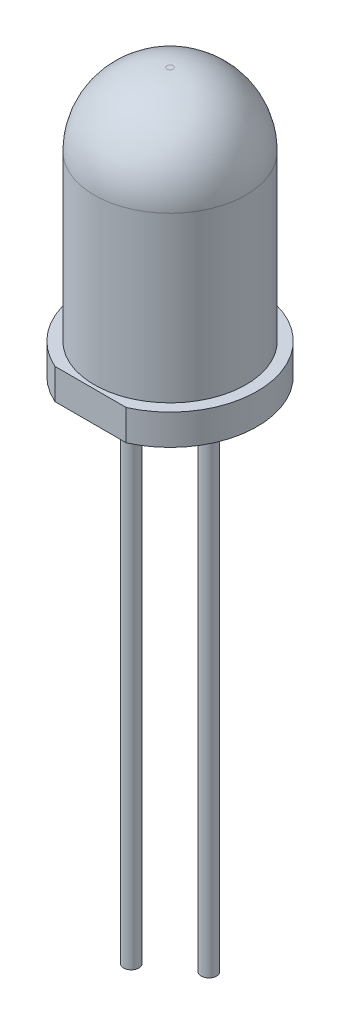
ISO-10303-21;
HEADER;
FILE_DESCRIPTION(('STEP AP214'),'2;1');
FILE_NAME('part.step','',(''),(''),'','','');
FILE_SCHEMA(('AUTOMOTIVE_DESIGN { 1 0 10303 214 1 1 1 1 }'));
ENDSEC;
DATA;
#1=APPLICATION_CONTEXT('core data for automotive mechanical design processes');
#2=APPLICATION_PROTOCOL_DEFINITION('international standard','automotive_design',2000,#1);
#3=PRODUCT_CONTEXT('',#1,'mechanical');
#4=PRODUCT('Part','Part','',(#3));
#5=PRODUCT_RELATED_PRODUCT_CATEGORY('part','',(#4));
#6=PRODUCT_DEFINITION_FORMATION('','',#4);
#7=PRODUCT_DEFINITION_CONTEXT('part definition',#1,'design');
#8=PRODUCT_DEFINITION('design','',#6,#7);
#9=PRODUCT_DEFINITION_SHAPE('','',#8);
#10=(LENGTH_UNIT() NAMED_UNIT(*) SI_UNIT(.MILLI.,.METRE.));
#11=(NAMED_UNIT(*) PLANE_ANGLE_UNIT() SI_UNIT($,.RADIAN.));
#12=(NAMED_UNIT(*) SI_UNIT($,.STERADIAN.) SOLID_ANGLE_UNIT());
#13=UNCERTAINTY_MEASURE_WITH_UNIT(LENGTH_MEASURE(1.E-05),#10,'distance_accuracy_value','');
#14=(GEOMETRIC_REPRESENTATION_CONTEXT(3) GLOBAL_UNCERTAINTY_ASSIGNED_CONTEXT((#13)) GLOBAL_UNIT_ASSIGNED_CONTEXT((#10,
#11,#12)) REPRESENTATION_CONTEXT('',''));
#15=CARTESIAN_POINT('',(0.,0.,0.));
#16=DIRECTION('',(0.,0.,1.));
#17=DIRECTION('',(1.,0.,0.));
#18=AXIS2_PLACEMENT_3D('',#15,#16,#17);
#19=CARTESIAN_POINT('',(0.,0.,0.));
#20=DIRECTION('',(0.,-1.,0.));
#21=DIRECTION('',(0.,0.,-1.));
#22=AXIS2_PLACEMENT_3D('',#19,#20,#21);
#23=PLANE('',#22);
#24=CARTESIAN_POINT('',(0.,0.,1.27));
#25=DIRECTION('',(0.,-1.,0.));
#26=DIRECTION('',(0.,0.,-1.));
#27=AXIS2_PLACEMENT_3D('',#24,#25,#26);
#28=CIRCLE('',#27,0.25);
#29=CARTESIAN_POINT('',(0.,0.,1.02));
#30=VERTEX_POINT('',#29);
#31=EDGE_CURVE('E90',#30,#30,#28,.T.);
#32=ORIENTED_EDGE('',*,*,#31,.F.);
#33=EDGE_LOOP('',(#32));
#34=FACE_BOUND('',#33,.T.);
#35=CARTESIAN_POINT('',(0.,0.,-1.27));
#36=DIRECTION('',(0.,-1.,0.));
#37=DIRECTION('',(0.,0.,-1.));
#38=AXIS2_PLACEMENT_3D('',#35,#36,#37);
#39=CIRCLE('',#38,0.25);
#40=CARTESIAN_POINT('',(0.,0.,-1.52));
#41=VERTEX_POINT('',#40);
#42=EDGE_CURVE('E86',#41,#41,#39,.T.);
#43=ORIENTED_EDGE('',*,*,#42,.F.);
#44=EDGE_LOOP('',(#43));
#45=FACE_BOUND('',#44,.T.);
#46=DIRECTION('',(1.,0.,0.));
#47=VECTOR('',#46,1.);
#48=CARTESIAN_POINT('',(-1.16726175299288,0.,2.6));
#49=LINE('',#48,#47);
#50=CARTESIAN_POINT('',(-1.16726175299288,0.,2.6));
#51=VERTEX_POINT('',#50);
#52=CARTESIAN_POINT('',(1.16726175299288,0.,2.6));
#53=VERTEX_POINT('',#52);
#54=EDGE_CURVE('E66',#51,#53,#49,.T.);
#55=ORIENTED_EDGE('',*,*,#54,.F.);
#56=CARTESIAN_POINT('',(0.,0.,0.));
#57=DIRECTION('',(0.,-1.,0.));
#58=DIRECTION('',(0.,0.,-1.));
#59=AXIS2_PLACEMENT_3D('',#56,#57,#58);
#60=CIRCLE('',#59,2.85);
#61=EDGE_CURVE('E11',#51,#53,#60,.T.);
#62=ORIENTED_EDGE('',*,*,#61,.T.);
#63=EDGE_LOOP('',(#55,#62));
#64=FACE_BOUND('',#63,.T.);
#65=ADVANCED_FACE('F37',(#34,#45,#64),#23,.T.);
#66=CARTESIAN_POINT('',(0.,0.,0.));
#67=DIRECTION('',(0.,-1.,0.));
#68=DIRECTION('',(0.,0.,-1.));
#69=AXIS2_PLACEMENT_3D('',#66,#67,#68);
#70=CYLINDRICAL_SURFACE('',#69,2.85);
#71=DIRECTION('',(0.,-1.,0.));
#72=VECTOR('',#71,1.);
#73=CARTESIAN_POINT('',(1.16726175299288,3.34787137637478,2.6));
#74=LINE('',#73,#72);
#75=CARTESIAN_POINT('',(1.16726175299288,1.,2.6));
#76=VERTEX_POINT('',#75);
#77=EDGE_CURVE('E51',#76,#53,#74,.T.);
#78=ORIENTED_EDGE('',*,*,#77,.T.);
#79=ORIENTED_EDGE('',*,*,#61,.F.);
#80=DIRECTION('',(0.,-1.,0.));
#81=VECTOR('',#80,1.);
#82=CARTESIAN_POINT('',(-1.16726175299288,3.34787137637478,2.6));
#83=LINE('',#82,#81);
#84=CARTESIAN_POINT('',(-1.16726175299288,1.,2.6));
#85=VERTEX_POINT('',#84);
#86=EDGE_CURVE('E57',#85,#51,#83,.T.);
#87=ORIENTED_EDGE('',*,*,#86,.F.);
#88=CARTESIAN_POINT('',(0.,1.,0.));
#89=DIRECTION('',(0.,-1.,0.));
#90=DIRECTION('',(0.,0.,-1.));
#91=AXIS2_PLACEMENT_3D('',#88,#89,#90);
#92=CIRCLE('',#91,2.85);
#93=EDGE_CURVE('E44',#85,#76,#92,.T.);
#94=ORIENTED_EDGE('',*,*,#93,.T.);
#95=EDGE_LOOP('',(#78,#79,#87,#94));
#96=FACE_BOUND('',#95,.T.);
#97=ADVANCED_FACE('F70',(#96),#70,.T.);
#98=CARTESIAN_POINT('',(2.85,1.,0.));
#99=DIRECTION('',(0.,1.,0.));
#100=DIRECTION('',(0.,0.,1.));
#101=AXIS2_PLACEMENT_3D('',#98,#99,#100);
#102=PLANE('',#101);
#103=DIRECTION('',(1.,0.,0.));
#104=VECTOR('',#103,1.);
#105=CARTESIAN_POINT('',(-1.16726175299288,1.,2.6));
#106=LINE('',#105,#104);
#107=EDGE_CURVE('E61',#85,#76,#106,.T.);
#108=ORIENTED_EDGE('',*,*,#107,.T.);
#109=ORIENTED_EDGE('',*,*,#93,.F.);
#110=EDGE_LOOP('',(#108,#109));
#111=FACE_BOUND('',#110,.T.);
#112=CARTESIAN_POINT('',(0.,1.,0.));
#113=DIRECTION('',(0.,-1.,0.));
#114=DIRECTION('',(0.,0.,-1.));
#115=AXIS2_PLACEMENT_3D('',#112,#113,#114);
#116=CIRCLE('',#115,2.48);
#117=CARTESIAN_POINT('',(0.,1.,-2.48));
#118=VERTEX_POINT('',#117);
#119=EDGE_CURVE('E75',#118,#118,#116,.T.);
#120=ORIENTED_EDGE('',*,*,#119,.T.);
#121=EDGE_LOOP('',(#120));
#122=FACE_BOUND('',#121,.T.);
#123=ADVANCED_FACE('F73',(#111,#122),#102,.T.);
#124=CARTESIAN_POINT('',(0.,0.,0.));
#125=DIRECTION('',(0.,-1.,0.));
#126=DIRECTION('',(0.,0.,-1.));
#127=AXIS2_PLACEMENT_3D('',#124,#125,#126);
#128=CYLINDRICAL_SURFACE('',#127,2.48);
#129=CARTESIAN_POINT('',(0.,6.37,0.));
#130=DIRECTION('',(0.,-1.,0.));
#131=DIRECTION('',(0.,0.,-1.));
#132=AXIS2_PLACEMENT_3D('',#129,#130,#131);
#133=CIRCLE('',#132,2.48);
#134=CARTESIAN_POINT('',(0.,6.37,-2.48));
#135=VERTEX_POINT('',#134);
#136=EDGE_CURVE('E77',#135,#135,#133,.T.);
#137=ORIENTED_EDGE('',*,*,#136,.T.);
#138=EDGE_LOOP('',(#137));
#139=FACE_BOUND('',#138,.T.);
#140=ORIENTED_EDGE('',*,*,#119,.F.);
#141=EDGE_LOOP('',(#140));
#142=FACE_BOUND('',#141,.T.);
#143=ADVANCED_FACE('F128',(#139,#142),#128,.T.);
#144=CARTESIAN_POINT('',(0.,6.37,0.));
#145=DIRECTION('',(0.,-1.,0.));
#146=DIRECTION('',(0.,0.,-1.));
#147=AXIS2_PLACEMENT_3D('',#144,#145,#146);
#148=DEGENERATE_TOROIDAL_SURFACE('',#147,0.1,2.38,.T.);
#149=CARTESIAN_POINT('',(0.,8.75,0.));
#150=DIRECTION('',(0.,-1.,0.));
#151=DIRECTION('',(0.,0.,-1.));
#152=AXIS2_PLACEMENT_3D('',#149,#150,#151);
#153=CIRCLE('',#152,0.1);
#154=CARTESIAN_POINT('',(0.,8.75,-0.1));
#155=VERTEX_POINT('',#154);
#156=EDGE_CURVE('E71',#155,#155,#153,.T.);
#157=ORIENTED_EDGE('',*,*,#156,.T.);
#158=EDGE_LOOP('',(#157));
#159=FACE_BOUND('',#158,.T.);
#160=ORIENTED_EDGE('',*,*,#136,.F.);
#161=EDGE_LOOP('',(#160));
#162=FACE_BOUND('',#161,.T.);
#163=ADVANCED_FACE('F133',(#159,#162),#148,.T.);
#164=CARTESIAN_POINT('',(0.,8.75,0.));
#165=DIRECTION('',(0.,1.,0.));
#166=DIRECTION('',(0.,0.,1.));
#167=AXIS2_PLACEMENT_3D('',#164,#165,#166);
#168=PLANE('',#167);
#169=ORIENTED_EDGE('',*,*,#156,.F.);
#170=EDGE_LOOP('',(#169));
#171=FACE_BOUND('',#170,.T.);
#172=ADVANCED_FACE('F113',(#171),#168,.T.);
#173=CARTESIAN_POINT('',(-1.16726175299288,3.34787137637478,2.6));
#174=DIRECTION('',(0.,0.,-1.));
#175=DIRECTION('',(-1.,0.,0.));
#176=AXIS2_PLACEMENT_3D('',#173,#174,#175);
#177=PLANE('',#176);
#178=ORIENTED_EDGE('',*,*,#86,.T.);
#179=ORIENTED_EDGE('',*,*,#54,.T.);
#180=ORIENTED_EDGE('',*,*,#77,.F.);
#181=ORIENTED_EDGE('',*,*,#107,.F.);
#182=EDGE_LOOP('',(#178,#179,#180,#181));
#183=FACE_BOUND('',#182,.T.);
#184=ADVANCED_FACE('F62',(#183),#177,.F.);
#185=CARTESIAN_POINT('',(0.,-16.,-1.27));
#186=DIRECTION('',(0.,1.,0.));
#187=DIRECTION('',(0.,0.,1.));
#188=AXIS2_PLACEMENT_3D('',#185,#186,#187);
#189=CYLINDRICAL_SURFACE('',#188,0.25);
#190=ORIENTED_EDGE('',*,*,#42,.T.);
#191=EDGE_LOOP('',(#190));
#192=FACE_BOUND('',#191,.T.);
#193=CARTESIAN_POINT('',(0.,-17.5,-1.27));
#194=DIRECTION('',(0.,-1.,0.));
#195=DIRECTION('',(0.,0.,-1.));
#196=AXIS2_PLACEMENT_3D('',#193,#194,#195);
#197=CIRCLE('',#196,0.25);
#198=CARTESIAN_POINT('',(0.,-17.5,-1.52));
#199=VERTEX_POINT('',#198);
#200=EDGE_CURVE('E93',#199,#199,#197,.T.);
#201=ORIENTED_EDGE('',*,*,#200,.F.);
#202=EDGE_LOOP('',(#201));
#203=FACE_BOUND('',#202,.T.);
#204=ADVANCED_FACE('F101',(#192,#203),#189,.T.);
#205=CARTESIAN_POINT('',(0.,-16.,1.27));
#206=DIRECTION('',(0.,1.,0.));
#207=DIRECTION('',(0.,0.,1.));
#208=AXIS2_PLACEMENT_3D('',#205,#206,#207);
#209=CYLINDRICAL_SURFACE('',#208,0.25);
#210=CARTESIAN_POINT('',(0.,-16.,1.27));
#211=DIRECTION('',(0.,-1.,0.));
#212=DIRECTION('',(0.,0.,-1.));
#213=AXIS2_PLACEMENT_3D('',#210,#211,#212);
#214=CIRCLE('',#213,0.25);
#215=CARTESIAN_POINT('',(0.,-16.,1.02));
#216=VERTEX_POINT('',#215);
#217=EDGE_CURVE('E89',#216,#216,#214,.T.);
#218=ORIENTED_EDGE('',*,*,#217,.F.);
#219=EDGE_LOOP('',(#218));
#220=FACE_BOUND('',#219,.T.);
#221=ORIENTED_EDGE('',*,*,#31,.T.);
#222=EDGE_LOOP('',(#221));
#223=FACE_BOUND('',#222,.T.);
#224=ADVANCED_FACE('F103',(#220,#223),#209,.T.);
#225=CARTESIAN_POINT('',(0.,-16.,1.27));
#226=DIRECTION('',(0.,-1.,0.));
#227=DIRECTION('',(0.,0.,-1.));
#228=AXIS2_PLACEMENT_3D('',#225,#226,#227);
#229=PLANE('',#228);
#230=ORIENTED_EDGE('',*,*,#217,.T.);
#231=EDGE_LOOP('',(#230));
#232=FACE_BOUND('',#231,.T.);
#233=ADVANCED_FACE('F110',(#232),#229,.T.);
#234=CARTESIAN_POINT('',(0.,-17.5,-1.27));
#235=DIRECTION('',(0.,-1.,0.));
#236=DIRECTION('',(0.,0.,-1.));
#237=AXIS2_PLACEMENT_3D('',#234,#235,#236);
#238=PLANE('',#237);
#239=ORIENTED_EDGE('',*,*,#200,.T.);
#240=EDGE_LOOP('',(#239));
#241=FACE_BOUND('',#240,.T.);
#242=ADVANCED_FACE('F99',(#241),#238,.T.);
#243=CLOSED_SHELL('',(#65,#97,#123,#143,#163,#172,#184,#204,#224,#233,#242));
#244=MANIFOLD_SOLID_BREP('B2',#243);
#245=ADVANCED_BREP_SHAPE_REPRESENTATION('',(#18,#244),#14);
#246=SHAPE_DEFINITION_REPRESENTATION(#9,#245);
ENDSEC;
END-ISO-10303-21;
